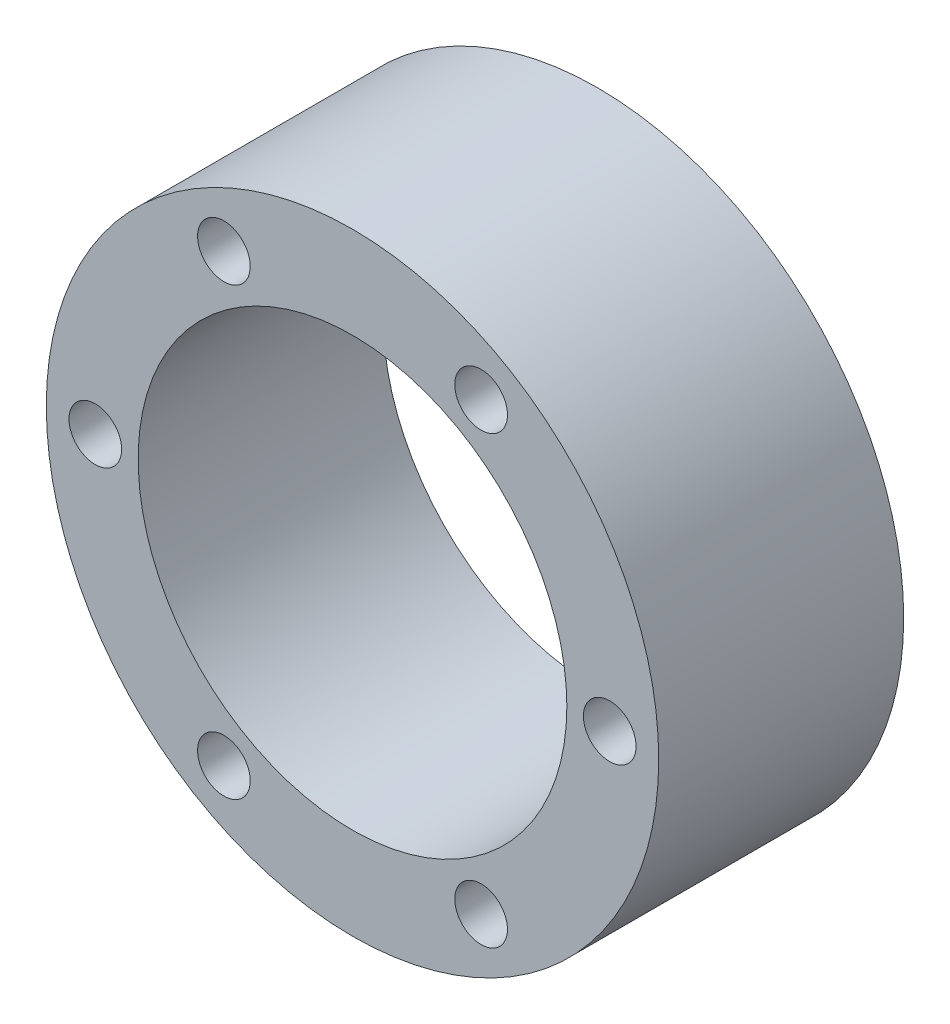
ISO-10303-21;
HEADER;
FILE_DESCRIPTION(('STEP AP214'),'2;1');
FILE_NAME('part.step','',(''),(''),'','','');
FILE_SCHEMA(('AUTOMOTIVE_DESIGN { 1 0 10303 214 1 1 1 1 }'));
ENDSEC;
DATA;
#1=APPLICATION_CONTEXT('core data for automotive mechanical design processes');
#2=APPLICATION_PROTOCOL_DEFINITION('international standard','automotive_design',2000,#1);
#3=PRODUCT_CONTEXT('',#1,'mechanical');
#4=PRODUCT('Part','Part','',(#3));
#5=PRODUCT_RELATED_PRODUCT_CATEGORY('part','',(#4));
#6=PRODUCT_DEFINITION_FORMATION('','',#4);
#7=PRODUCT_DEFINITION_CONTEXT('part definition',#1,'design');
#8=PRODUCT_DEFINITION('design','',#6,#7);
#9=PRODUCT_DEFINITION_SHAPE('','',#8);
#10=(LENGTH_UNIT() NAMED_UNIT(*) SI_UNIT(.MILLI.,.METRE.));
#11=(NAMED_UNIT(*) PLANE_ANGLE_UNIT() SI_UNIT($,.RADIAN.));
#12=(NAMED_UNIT(*) SI_UNIT($,.STERADIAN.) SOLID_ANGLE_UNIT());
#13=UNCERTAINTY_MEASURE_WITH_UNIT(LENGTH_MEASURE(1.E-05),#10,'distance_accuracy_value','');
#14=(GEOMETRIC_REPRESENTATION_CONTEXT(3) GLOBAL_UNCERTAINTY_ASSIGNED_CONTEXT((#13)) GLOBAL_UNIT_ASSIGNED_CONTEXT((#10,
#11,#12)) REPRESENTATION_CONTEXT('',''));
#15=CARTESIAN_POINT('',(0.,0.,0.));
#16=DIRECTION('',(0.,0.,1.));
#17=DIRECTION('',(1.,0.,0.));
#18=AXIS2_PLACEMENT_3D('',#15,#16,#17);
#19=CARTESIAN_POINT('',(0.,0.,20.));
#20=DIRECTION('',(0.,0.,1.));
#21=DIRECTION('',(1.,0.,0.));
#22=AXIS2_PLACEMENT_3D('',#19,#20,#21);
#23=PLANE('',#22);
#24=CARTESIAN_POINT('',(21.,0.,20.));
#25=DIRECTION('',(0.,0.,1.));
#26=DIRECTION('',(1.,0.,0.));
#27=AXIS2_PLACEMENT_3D('',#24,#25,#26);
#28=CIRCLE('',#27,2.14999999999999);
#29=CARTESIAN_POINT('',(23.15,0.,20.));
#30=VERTEX_POINT('',#29);
#31=EDGE_CURVE('E82',#30,#30,#28,.T.);
#32=ORIENTED_EDGE('',*,*,#31,.F.);
#33=EDGE_LOOP('',(#32));
#34=FACE_BOUND('',#33,.T.);
#35=CARTESIAN_POINT('',(10.5,-18.1865334794732,20.));
#36=DIRECTION('',(0.,0.,1.));
#37=DIRECTION('',(1.,0.,0.));
#38=AXIS2_PLACEMENT_3D('',#35,#36,#37);
#39=CIRCLE('',#38,2.14999999999999);
#40=CARTESIAN_POINT('',(12.65,-18.1865334794732,20.));
#41=VERTEX_POINT('',#40);
#42=EDGE_CURVE('E76',#41,#41,#39,.T.);
#43=ORIENTED_EDGE('',*,*,#42,.F.);
#44=EDGE_LOOP('',(#43));
#45=FACE_BOUND('',#44,.T.);
#46=CARTESIAN_POINT('',(-10.5,-18.1865334794732,20.));
#47=DIRECTION('',(0.,0.,1.));
#48=DIRECTION('',(1.,0.,0.));
#49=AXIS2_PLACEMENT_3D('',#46,#47,#48);
#50=CIRCLE('',#49,2.14999999999999);
#51=CARTESIAN_POINT('',(-8.35000000000001,-18.1865334794732,20.));
#52=VERTEX_POINT('',#51);
#53=EDGE_CURVE('E70',#52,#52,#50,.T.);
#54=ORIENTED_EDGE('',*,*,#53,.F.);
#55=EDGE_LOOP('',(#54));
#56=FACE_BOUND('',#55,.T.);
#57=CARTESIAN_POINT('',(-21.,0.,20.));
#58=DIRECTION('',(0.,0.,1.));
#59=DIRECTION('',(1.,0.,0.));
#60=AXIS2_PLACEMENT_3D('',#57,#58,#59);
#61=CIRCLE('',#60,2.14999999999999);
#62=CARTESIAN_POINT('',(-18.85,0.,20.));
#63=VERTEX_POINT('',#62);
#64=EDGE_CURVE('E64',#63,#63,#61,.T.);
#65=ORIENTED_EDGE('',*,*,#64,.F.);
#66=EDGE_LOOP('',(#65));
#67=FACE_BOUND('',#66,.T.);
#68=CARTESIAN_POINT('',(-10.5,18.1865334794732,20.));
#69=DIRECTION('',(0.,0.,1.));
#70=DIRECTION('',(1.,0.,0.));
#71=AXIS2_PLACEMENT_3D('',#68,#69,#70);
#72=CIRCLE('',#71,2.14999999999999);
#73=CARTESIAN_POINT('',(-8.35000000000002,18.1865334794732,20.));
#74=VERTEX_POINT('',#73);
#75=EDGE_CURVE('E58',#74,#74,#72,.T.);
#76=ORIENTED_EDGE('',*,*,#75,.F.);
#77=EDGE_LOOP('',(#76));
#78=FACE_BOUND('',#77,.T.);
#79=CARTESIAN_POINT('',(10.5,18.1865334794732,20.));
#80=DIRECTION('',(0.,0.,1.));
#81=DIRECTION('',(1.,0.,0.));
#82=AXIS2_PLACEMENT_3D('',#79,#80,#81);
#83=CIRCLE('',#82,2.14999999999999);
#84=CARTESIAN_POINT('',(12.65,18.1865334794732,20.));
#85=VERTEX_POINT('',#84);
#86=EDGE_CURVE('E52',#85,#85,#83,.T.);
#87=ORIENTED_EDGE('',*,*,#86,.F.);
#88=EDGE_LOOP('',(#87));
#89=FACE_BOUND('',#88,.T.);
#90=CARTESIAN_POINT('',(0.,0.,20.));
#91=DIRECTION('',(0.,0.,1.));
#92=DIRECTION('',(1.,0.,0.));
#93=AXIS2_PLACEMENT_3D('',#90,#91,#92);
#94=CIRCLE('',#93,25.);
#95=CARTESIAN_POINT('',(25.,0.,20.));
#96=VERTEX_POINT('',#95);
#97=EDGE_CURVE('E10',#96,#96,#94,.T.);
#98=ORIENTED_EDGE('',*,*,#97,.T.);
#99=EDGE_LOOP('',(#98));
#100=FACE_BOUND('',#99,.T.);
#101=CARTESIAN_POINT('',(0.,0.,20.));
#102=DIRECTION('',(0.,0.,1.));
#103=DIRECTION('',(1.,0.,0.));
#104=AXIS2_PLACEMENT_3D('',#101,#102,#103);
#105=CIRCLE('',#104,17.5);
#106=CARTESIAN_POINT('',(17.5,0.,20.));
#107=VERTEX_POINT('',#106);
#108=EDGE_CURVE('E42',#107,#107,#105,.T.);
#109=ORIENTED_EDGE('',*,*,#108,.F.);
#110=EDGE_LOOP('',(#109));
#111=FACE_BOUND('',#110,.T.);
#112=ADVANCED_FACE('F31',(#34,#45,#56,#67,#78,#89,#100,#111),#23,.T.);
#113=CARTESIAN_POINT('',(0.,0.,0.));
#114=DIRECTION('',(0.,0.,1.));
#115=DIRECTION('',(1.,0.,0.));
#116=AXIS2_PLACEMENT_3D('',#113,#114,#115);
#117=PLANE('',#116);
#118=CARTESIAN_POINT('',(21.,0.,0.));
#119=DIRECTION('',(0.,0.,1.));
#120=DIRECTION('',(1.,0.,0.));
#121=AXIS2_PLACEMENT_3D('',#118,#119,#120);
#122=CIRCLE('',#121,2.15);
#123=CARTESIAN_POINT('',(23.15,0.,0.));
#124=VERTEX_POINT('',#123);
#125=EDGE_CURVE('E79',#124,#124,#122,.T.);
#126=ORIENTED_EDGE('',*,*,#125,.T.);
#127=EDGE_LOOP('',(#126));
#128=FACE_BOUND('',#127,.T.);
#129=CARTESIAN_POINT('',(10.5,-18.1865334794732,0.));
#130=DIRECTION('',(0.,0.,1.));
#131=DIRECTION('',(1.,0.,0.));
#132=AXIS2_PLACEMENT_3D('',#129,#130,#131);
#133=CIRCLE('',#132,2.15);
#134=CARTESIAN_POINT('',(12.65,-18.1865334794732,0.));
#135=VERTEX_POINT('',#134);
#136=EDGE_CURVE('E73',#135,#135,#133,.T.);
#137=ORIENTED_EDGE('',*,*,#136,.T.);
#138=EDGE_LOOP('',(#137));
#139=FACE_BOUND('',#138,.T.);
#140=CARTESIAN_POINT('',(-10.5,-18.1865334794732,0.));
#141=DIRECTION('',(0.,0.,1.));
#142=DIRECTION('',(1.,0.,0.));
#143=AXIS2_PLACEMENT_3D('',#140,#141,#142);
#144=CIRCLE('',#143,2.15);
#145=CARTESIAN_POINT('',(-8.35,-18.1865334794732,0.));
#146=VERTEX_POINT('',#145);
#147=EDGE_CURVE('E67',#146,#146,#144,.T.);
#148=ORIENTED_EDGE('',*,*,#147,.T.);
#149=EDGE_LOOP('',(#148));
#150=FACE_BOUND('',#149,.T.);
#151=CARTESIAN_POINT('',(-21.,0.,0.));
#152=DIRECTION('',(0.,0.,1.));
#153=DIRECTION('',(1.,0.,0.));
#154=AXIS2_PLACEMENT_3D('',#151,#152,#153);
#155=CIRCLE('',#154,2.15);
#156=CARTESIAN_POINT('',(-18.85,0.,0.));
#157=VERTEX_POINT('',#156);
#158=EDGE_CURVE('E61',#157,#157,#155,.T.);
#159=ORIENTED_EDGE('',*,*,#158,.T.);
#160=EDGE_LOOP('',(#159));
#161=FACE_BOUND('',#160,.T.);
#162=CARTESIAN_POINT('',(-10.5,18.1865334794732,0.));
#163=DIRECTION('',(0.,0.,1.));
#164=DIRECTION('',(1.,0.,0.));
#165=AXIS2_PLACEMENT_3D('',#162,#163,#164);
#166=CIRCLE('',#165,2.15);
#167=CARTESIAN_POINT('',(-8.35000000000001,18.1865334794732,0.));
#168=VERTEX_POINT('',#167);
#169=EDGE_CURVE('E55',#168,#168,#166,.T.);
#170=ORIENTED_EDGE('',*,*,#169,.T.);
#171=EDGE_LOOP('',(#170));
#172=FACE_BOUND('',#171,.T.);
#173=CARTESIAN_POINT('',(10.5,18.1865334794732,0.));
#174=DIRECTION('',(0.,0.,1.));
#175=DIRECTION('',(1.,0.,0.));
#176=AXIS2_PLACEMENT_3D('',#173,#174,#175);
#177=CIRCLE('',#176,2.15);
#178=CARTESIAN_POINT('',(12.65,18.1865334794732,0.));
#179=VERTEX_POINT('',#178);
#180=EDGE_CURVE('E47',#179,#179,#177,.T.);
#181=ORIENTED_EDGE('',*,*,#180,.T.);
#182=EDGE_LOOP('',(#181));
#183=FACE_BOUND('',#182,.T.);
#184=CARTESIAN_POINT('',(0.,0.,0.));
#185=DIRECTION('',(0.,0.,1.));
#186=DIRECTION('',(1.,0.,0.));
#187=AXIS2_PLACEMENT_3D('',#184,#185,#186);
#188=CIRCLE('',#187,25.);
#189=CARTESIAN_POINT('',(25.,0.,0.));
#190=VERTEX_POINT('',#189);
#191=EDGE_CURVE('E35',#190,#190,#188,.T.);
#192=ORIENTED_EDGE('',*,*,#191,.F.);
#193=EDGE_LOOP('',(#192));
#194=FACE_BOUND('',#193,.T.);
#195=CARTESIAN_POINT('',(0.,0.,0.));
#196=DIRECTION('',(0.,0.,1.));
#197=DIRECTION('',(1.,0.,0.));
#198=AXIS2_PLACEMENT_3D('',#195,#196,#197);
#199=CIRCLE('',#198,17.5);
#200=CARTESIAN_POINT('',(17.5,0.,0.));
#201=VERTEX_POINT('',#200);
#202=EDGE_CURVE('E44',#201,#201,#199,.T.);
#203=ORIENTED_EDGE('',*,*,#202,.T.);
#204=EDGE_LOOP('',(#203));
#205=FACE_BOUND('',#204,.T.);
#206=ADVANCED_FACE('F90',(#128,#139,#150,#161,#172,#183,#194,#205),#117,.F.);
#207=CARTESIAN_POINT('',(0.,0.,20.));
#208=DIRECTION('',(0.,0.,-1.));
#209=DIRECTION('',(-1.,0.,0.));
#210=AXIS2_PLACEMENT_3D('',#207,#208,#209);
#211=CYLINDRICAL_SURFACE('',#210,25.);
#212=ORIENTED_EDGE('',*,*,#97,.F.);
#213=EDGE_LOOP('',(#212));
#214=FACE_BOUND('',#213,.T.);
#215=ORIENTED_EDGE('',*,*,#191,.T.);
#216=EDGE_LOOP('',(#215));
#217=FACE_BOUND('',#216,.T.);
#218=ADVANCED_FACE('F33',(#214,#217),#211,.T.);
#219=CARTESIAN_POINT('',(0.,0.,20.));
#220=DIRECTION('',(0.,0.,-1.));
#221=DIRECTION('',(-1.,0.,0.));
#222=AXIS2_PLACEMENT_3D('',#219,#220,#221);
#223=CYLINDRICAL_SURFACE('',#222,17.5);
#224=ORIENTED_EDGE('',*,*,#108,.T.);
#225=EDGE_LOOP('',(#224));
#226=FACE_BOUND('',#225,.T.);
#227=ORIENTED_EDGE('',*,*,#202,.F.);
#228=EDGE_LOOP('',(#227));
#229=FACE_BOUND('',#228,.T.);
#230=ADVANCED_FACE('F104',(#226,#229),#223,.F.);
#231=CARTESIAN_POINT('',(10.5,18.1865334794732,20.));
#232=DIRECTION('',(0.,0.,1.));
#233=DIRECTION('',(1.,0.,0.));
#234=AXIS2_PLACEMENT_3D('',#231,#232,#233);
#235=CYLINDRICAL_SURFACE('',#234,2.14999999999999);
#236=ORIENTED_EDGE('',*,*,#180,.F.);
#237=EDGE_LOOP('',(#236));
#238=FACE_BOUND('',#237,.T.);
#239=ORIENTED_EDGE('',*,*,#86,.T.);
#240=EDGE_LOOP('',(#239));
#241=FACE_BOUND('',#240,.T.);
#242=ADVANCED_FACE('F107',(#238,#241),#235,.F.);
#243=CARTESIAN_POINT('',(-10.5,18.1865334794732,20.));
#244=DIRECTION('',(0.,0.,1.));
#245=DIRECTION('',(1.,0.,0.));
#246=AXIS2_PLACEMENT_3D('',#243,#244,#245);
#247=CYLINDRICAL_SURFACE('',#246,2.14999999999999);
#248=ORIENTED_EDGE('',*,*,#169,.F.);
#249=EDGE_LOOP('',(#248));
#250=FACE_BOUND('',#249,.T.);
#251=ORIENTED_EDGE('',*,*,#75,.T.);
#252=EDGE_LOOP('',(#251));
#253=FACE_BOUND('',#252,.T.);
#254=ADVANCED_FACE('F121',(#250,#253),#247,.F.);
#255=CARTESIAN_POINT('',(-21.,0.,20.));
#256=DIRECTION('',(0.,0.,1.));
#257=DIRECTION('',(1.,0.,0.));
#258=AXIS2_PLACEMENT_3D('',#255,#256,#257);
#259=CYLINDRICAL_SURFACE('',#258,2.14999999999999);
#260=ORIENTED_EDGE('',*,*,#158,.F.);
#261=EDGE_LOOP('',(#260));
#262=FACE_BOUND('',#261,.T.);
#263=ORIENTED_EDGE('',*,*,#64,.T.);
#264=EDGE_LOOP('',(#263));
#265=FACE_BOUND('',#264,.T.);
#266=ADVANCED_FACE('F125',(#262,#265),#259,.F.);
#267=CARTESIAN_POINT('',(-10.5,-18.1865334794732,20.));
#268=DIRECTION('',(0.,0.,1.));
#269=DIRECTION('',(1.,0.,0.));
#270=AXIS2_PLACEMENT_3D('',#267,#268,#269);
#271=CYLINDRICAL_SURFACE('',#270,2.14999999999999);
#272=ORIENTED_EDGE('',*,*,#147,.F.);
#273=EDGE_LOOP('',(#272));
#274=FACE_BOUND('',#273,.T.);
#275=ORIENTED_EDGE('',*,*,#53,.T.);
#276=EDGE_LOOP('',(#275));
#277=FACE_BOUND('',#276,.T.);
#278=ADVANCED_FACE('F129',(#274,#277),#271,.F.);
#279=CARTESIAN_POINT('',(10.5,-18.1865334794732,20.));
#280=DIRECTION('',(0.,0.,1.));
#281=DIRECTION('',(1.,0.,0.));
#282=AXIS2_PLACEMENT_3D('',#279,#280,#281);
#283=CYLINDRICAL_SURFACE('',#282,2.14999999999999);
#284=ORIENTED_EDGE('',*,*,#136,.F.);
#285=EDGE_LOOP('',(#284));
#286=FACE_BOUND('',#285,.T.);
#287=ORIENTED_EDGE('',*,*,#42,.T.);
#288=EDGE_LOOP('',(#287));
#289=FACE_BOUND('',#288,.T.);
#290=ADVANCED_FACE('F133',(#286,#289),#283,.F.);
#291=CARTESIAN_POINT('',(21.,0.,20.));
#292=DIRECTION('',(0.,0.,1.));
#293=DIRECTION('',(1.,0.,0.));
#294=AXIS2_PLACEMENT_3D('',#291,#292,#293);
#295=CYLINDRICAL_SURFACE('',#294,2.14999999999999);
#296=ORIENTED_EDGE('',*,*,#125,.F.);
#297=EDGE_LOOP('',(#296));
#298=FACE_BOUND('',#297,.T.);
#299=ORIENTED_EDGE('',*,*,#31,.T.);
#300=EDGE_LOOP('',(#299));
#301=FACE_BOUND('',#300,.T.);
#302=ADVANCED_FACE('F86',(#298,#301),#295,.F.);
#303=CLOSED_SHELL('',(#112,#206,#218,#230,#242,#254,#266,#278,#290,#302));
#304=MANIFOLD_SOLID_BREP('B2',#303);
#305=ADVANCED_BREP_SHAPE_REPRESENTATION('',(#18,#304),#14);
#306=SHAPE_DEFINITION_REPRESENTATION(#9,#305);
ENDSEC;
END-ISO-10303-21;
